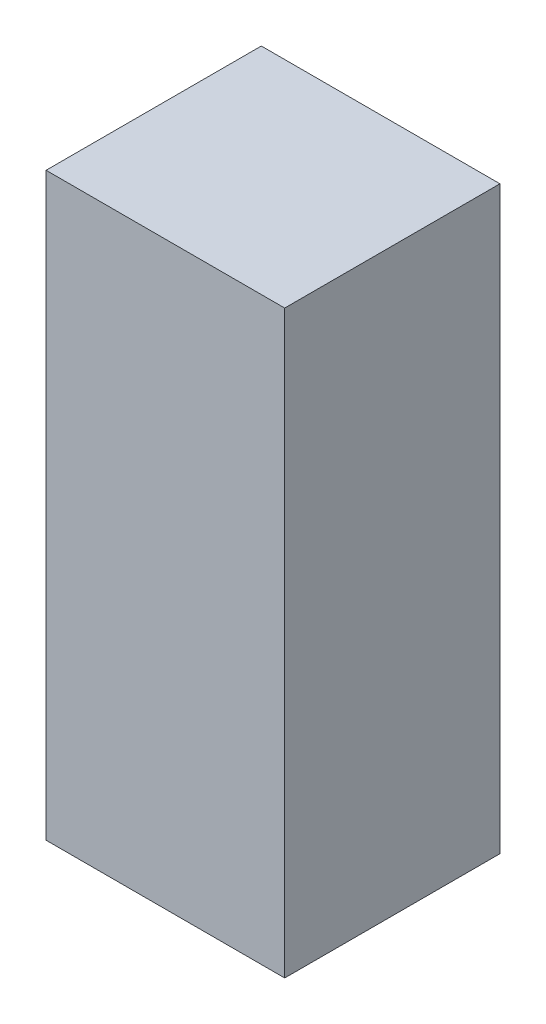
ISO-10303-21;
HEADER;
FILE_DESCRIPTION(('STEP AP214'),'2;1');
FILE_NAME('part.step','',(''),(''),'','','');
FILE_SCHEMA(('AUTOMOTIVE_DESIGN { 1 0 10303 214 1 1 1 1 }'));
ENDSEC;
DATA;
#1=APPLICATION_CONTEXT('core data for automotive mechanical design processes');
#2=APPLICATION_PROTOCOL_DEFINITION('international standard','automotive_design',2000,#1);
#3=PRODUCT_CONTEXT('',#1,'mechanical');
#4=PRODUCT('Part','Part','',(#3));
#5=PRODUCT_RELATED_PRODUCT_CATEGORY('part','',(#4));
#6=PRODUCT_DEFINITION_FORMATION('','',#4);
#7=PRODUCT_DEFINITION_CONTEXT('part definition',#1,'design');
#8=PRODUCT_DEFINITION('design','',#6,#7);
#9=PRODUCT_DEFINITION_SHAPE('','',#8);
#10=(LENGTH_UNIT() NAMED_UNIT(*) SI_UNIT(.MILLI.,.METRE.));
#11=(NAMED_UNIT(*) PLANE_ANGLE_UNIT() SI_UNIT($,.RADIAN.));
#12=(NAMED_UNIT(*) SI_UNIT($,.STERADIAN.) SOLID_ANGLE_UNIT());
#13=UNCERTAINTY_MEASURE_WITH_UNIT(LENGTH_MEASURE(1.E-05),#10,'distance_accuracy_value','');
#14=(GEOMETRIC_REPRESENTATION_CONTEXT(3) GLOBAL_UNCERTAINTY_ASSIGNED_CONTEXT((#13)) GLOBAL_UNIT_ASSIGNED_CONTEXT((#10,
#11,#12)) REPRESENTATION_CONTEXT('',''));
#15=CARTESIAN_POINT('',(0.,0.,0.));
#16=DIRECTION('',(0.,0.,1.));
#17=DIRECTION('',(1.,0.,0.));
#18=AXIS2_PLACEMENT_3D('',#15,#16,#17);
#19=CARTESIAN_POINT('',(-323.85,1574.8,292.1));
#20=DIRECTION('',(1.,0.,0.));
#21=DIRECTION('',(0.,0.,-1.));
#22=AXIS2_PLACEMENT_3D('',#19,#20,#21);
#23=PLANE('',#22);
#24=DIRECTION('',(0.,0.,1.));
#25=VECTOR('',#24,1.);
#26=CARTESIAN_POINT('',(-323.85,0.,292.1));
#27=LINE('',#26,#25);
#28=CARTESIAN_POINT('',(-323.85,0.,-292.1));
#29=VERTEX_POINT('',#28);
#30=CARTESIAN_POINT('',(-323.85,0.,292.1));
#31=VERTEX_POINT('',#30);
#32=EDGE_CURVE('E98',#29,#31,#27,.T.);
#33=ORIENTED_EDGE('',*,*,#32,.T.);
#34=DIRECTION('',(0.,-1.,0.));
#35=VECTOR('',#34,1.);
#36=CARTESIAN_POINT('',(-323.85,1574.8,292.1));
#37=LINE('',#36,#35);
#38=CARTESIAN_POINT('',(-323.85,1574.8,292.1));
#39=VERTEX_POINT('',#38);
#40=EDGE_CURVE('E11',#39,#31,#37,.T.);
#41=ORIENTED_EDGE('',*,*,#40,.F.);
#42=DIRECTION('',(0.,0.,1.));
#43=VECTOR('',#42,1.);
#44=CARTESIAN_POINT('',(-323.85,1574.8,292.1));
#45=LINE('',#44,#43);
#46=CARTESIAN_POINT('',(-323.85,1574.8,-292.1));
#47=VERTEX_POINT('',#46);
#48=EDGE_CURVE('E86',#47,#39,#45,.T.);
#49=ORIENTED_EDGE('',*,*,#48,.F.);
#50=DIRECTION('',(0.,-1.,0.));
#51=VECTOR('',#50,1.);
#52=CARTESIAN_POINT('',(-323.85,1574.8,-292.1));
#53=LINE('',#52,#51);
#54=EDGE_CURVE('E94',#47,#29,#53,.T.);
#55=ORIENTED_EDGE('',*,*,#54,.T.);
#56=EDGE_LOOP('',(#33,#41,#49,#55));
#57=FACE_BOUND('',#56,.T.);
#58=ADVANCED_FACE('F35',(#57),#23,.F.);
#59=CARTESIAN_POINT('',(323.85,1574.8,292.1));
#60=DIRECTION('',(0.,0.,-1.));
#61=DIRECTION('',(-1.,0.,0.));
#62=AXIS2_PLACEMENT_3D('',#59,#60,#61);
#63=PLANE('',#62);
#64=DIRECTION('',(1.,0.,0.));
#65=VECTOR('',#64,1.);
#66=CARTESIAN_POINT('',(323.85,0.,292.1));
#67=LINE('',#66,#65);
#68=CARTESIAN_POINT('',(323.85,0.,292.1));
#69=VERTEX_POINT('',#68);
#70=EDGE_CURVE('E90',#31,#69,#67,.T.);
#71=ORIENTED_EDGE('',*,*,#70,.T.);
#72=DIRECTION('',(0.,-1.,0.));
#73=VECTOR('',#72,1.);
#74=CARTESIAN_POINT('',(323.85,1574.8,292.1));
#75=LINE('',#74,#73);
#76=CARTESIAN_POINT('',(323.85,1574.8,292.1));
#77=VERTEX_POINT('',#76);
#78=EDGE_CURVE('E43',#77,#69,#75,.T.);
#79=ORIENTED_EDGE('',*,*,#78,.F.);
#80=DIRECTION('',(1.,0.,0.));
#81=VECTOR('',#80,1.);
#82=CARTESIAN_POINT('',(323.85,1574.8,292.1));
#83=LINE('',#82,#81);
#84=EDGE_CURVE('E81',#39,#77,#83,.T.);
#85=ORIENTED_EDGE('',*,*,#84,.F.);
#86=ORIENTED_EDGE('',*,*,#40,.T.);
#87=EDGE_LOOP('',(#71,#79,#85,#86));
#88=FACE_BOUND('',#87,.T.);
#89=ADVANCED_FACE('F89',(#88),#63,.F.);
#90=CARTESIAN_POINT('',(323.85,1574.8,292.1));
#91=DIRECTION('',(-1.,0.,0.));
#92=DIRECTION('',(0.,0.,1.));
#93=AXIS2_PLACEMENT_3D('',#90,#91,#92);
#94=PLANE('',#93);
#95=DIRECTION('',(0.,0.,-1.));
#96=VECTOR('',#95,1.);
#97=CARTESIAN_POINT('',(323.85,0.,292.1));
#98=LINE('',#97,#96);
#99=CARTESIAN_POINT('',(323.85,0.,-292.1));
#100=VERTEX_POINT('',#99);
#101=EDGE_CURVE('E68',#69,#100,#98,.T.);
#102=ORIENTED_EDGE('',*,*,#101,.T.);
#103=DIRECTION('',(0.,-1.,0.));
#104=VECTOR('',#103,1.);
#105=CARTESIAN_POINT('',(323.85,1574.8,-292.1));
#106=LINE('',#105,#104);
#107=CARTESIAN_POINT('',(323.85,1574.8,-292.1));
#108=VERTEX_POINT('',#107);
#109=EDGE_CURVE('E91',#108,#100,#106,.T.);
#110=ORIENTED_EDGE('',*,*,#109,.F.);
#111=DIRECTION('',(0.,0.,-1.));
#112=VECTOR('',#111,1.);
#113=CARTESIAN_POINT('',(323.85,1574.8,292.1));
#114=LINE('',#113,#112);
#115=EDGE_CURVE('E84',#77,#108,#114,.T.);
#116=ORIENTED_EDGE('',*,*,#115,.F.);
#117=ORIENTED_EDGE('',*,*,#78,.T.);
#118=EDGE_LOOP('',(#102,#110,#116,#117));
#119=FACE_BOUND('',#118,.T.);
#120=ADVANCED_FACE('F92',(#119),#94,.F.);
#121=CARTESIAN_POINT('',(323.85,1574.8,-292.1));
#122=DIRECTION('',(0.,0.,1.));
#123=DIRECTION('',(1.,0.,0.));
#124=AXIS2_PLACEMENT_3D('',#121,#122,#123);
#125=PLANE('',#124);
#126=DIRECTION('',(-1.,0.,0.));
#127=VECTOR('',#126,1.);
#128=CARTESIAN_POINT('',(323.85,0.,-292.1));
#129=LINE('',#128,#127);
#130=EDGE_CURVE('E74',#100,#29,#129,.T.);
#131=ORIENTED_EDGE('',*,*,#130,.T.);
#132=ORIENTED_EDGE('',*,*,#54,.F.);
#133=DIRECTION('',(-1.,0.,0.));
#134=VECTOR('',#133,1.);
#135=CARTESIAN_POINT('',(323.85,1574.8,-292.1));
#136=LINE('',#135,#134);
#137=EDGE_CURVE('E51',#108,#47,#136,.T.);
#138=ORIENTED_EDGE('',*,*,#137,.F.);
#139=ORIENTED_EDGE('',*,*,#109,.T.);
#140=EDGE_LOOP('',(#131,#132,#138,#139));
#141=FACE_BOUND('',#140,.T.);
#142=ADVANCED_FACE('F105',(#141),#125,.F.);
#143=CARTESIAN_POINT('',(0.,1574.8,0.));
#144=DIRECTION('',(0.,1.,0.));
#145=DIRECTION('',(0.,0.,1.));
#146=AXIS2_PLACEMENT_3D('',#143,#144,#145);
#147=PLANE('',#146);
#148=ORIENTED_EDGE('',*,*,#48,.T.);
#149=ORIENTED_EDGE('',*,*,#84,.T.);
#150=ORIENTED_EDGE('',*,*,#115,.T.);
#151=ORIENTED_EDGE('',*,*,#137,.T.);
#152=EDGE_LOOP('',(#148,#149,#150,#151));
#153=FACE_BOUND('',#152,.T.);
#154=ADVANCED_FACE('F82',(#153),#147,.T.);
#155=CARTESIAN_POINT('',(0.,0.,0.));
#156=DIRECTION('',(0.,1.,0.));
#157=DIRECTION('',(0.,0.,1.));
#158=AXIS2_PLACEMENT_3D('',#155,#156,#157);
#159=PLANE('',#158);
#160=ORIENTED_EDGE('',*,*,#32,.F.);
#161=ORIENTED_EDGE('',*,*,#130,.F.);
#162=ORIENTED_EDGE('',*,*,#101,.F.);
#163=ORIENTED_EDGE('',*,*,#70,.F.);
#164=EDGE_LOOP('',(#160,#161,#162,#163));
#165=FACE_BOUND('',#164,.T.);
#166=ADVANCED_FACE('F108',(#165),#159,.F.);
#167=CLOSED_SHELL('',(#58,#89,#120,#142,#154,#166));
#168=MANIFOLD_SOLID_BREP('B2',#167);
#169=ADVANCED_BREP_SHAPE_REPRESENTATION('',(#18,#168),#14);
#170=SHAPE_DEFINITION_REPRESENTATION(#9,#169);
ENDSEC;
END-ISO-10303-21;
